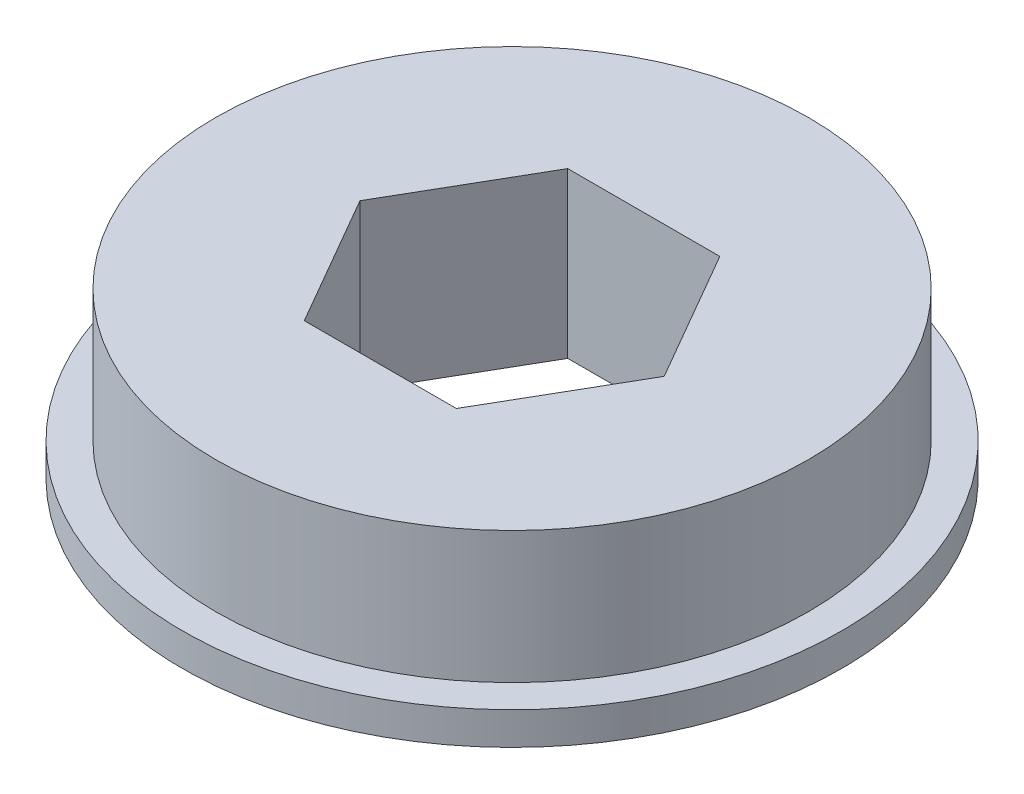
ISO-10303-21;
HEADER;
FILE_DESCRIPTION(('STEP AP214'),'2;1');
FILE_NAME('part.step','',(''),(''),'','','');
FILE_SCHEMA(('AUTOMOTIVE_DESIGN { 1 0 10303 214 1 1 1 1 }'));
ENDSEC;
DATA;
#1=APPLICATION_CONTEXT('core data for automotive mechanical design processes');
#2=APPLICATION_PROTOCOL_DEFINITION('international standard','automotive_design',2000,#1);
#3=PRODUCT_CONTEXT('',#1,'mechanical');
#4=PRODUCT('Part','Part','',(#3));
#5=PRODUCT_RELATED_PRODUCT_CATEGORY('part','',(#4));
#6=PRODUCT_DEFINITION_FORMATION('','',#4);
#7=PRODUCT_DEFINITION_CONTEXT('part definition',#1,'design');
#8=PRODUCT_DEFINITION('design','',#6,#7);
#9=PRODUCT_DEFINITION_SHAPE('','',#8);
#10=(LENGTH_UNIT() NAMED_UNIT(*) SI_UNIT(.MILLI.,.METRE.));
#11=(NAMED_UNIT(*) PLANE_ANGLE_UNIT() SI_UNIT($,.RADIAN.));
#12=(NAMED_UNIT(*) SI_UNIT($,.STERADIAN.) SOLID_ANGLE_UNIT());
#13=UNCERTAINTY_MEASURE_WITH_UNIT(LENGTH_MEASURE(1.E-05),#10,'distance_accuracy_value','');
#14=(GEOMETRIC_REPRESENTATION_CONTEXT(3) GLOBAL_UNCERTAINTY_ASSIGNED_CONTEXT((#13)) GLOBAL_UNIT_ASSIGNED_CONTEXT((#10,
#11,#12)) REPRESENTATION_CONTEXT('',''));
#15=CARTESIAN_POINT('',(0.,0.,0.));
#16=DIRECTION('',(0.,0.,1.));
#17=DIRECTION('',(1.,0.,0.));
#18=AXIS2_PLACEMENT_3D('',#15,#16,#17);
#19=CARTESIAN_POINT('',(0.,6.35,0.));
#20=DIRECTION('',(0.,1.,0.));
#21=DIRECTION('',(0.,0.,1.));
#22=AXIS2_PLACEMENT_3D('',#19,#20,#21);
#23=PLANE('',#22);
#24=CARTESIAN_POINT('',(0.,6.35,0.));
#25=DIRECTION('',(0.,1.,0.));
#26=DIRECTION('',(0.,0.,1.));
#27=AXIS2_PLACEMENT_3D('',#24,#25,#26);
#28=CIRCLE('',#27,14.2875);
#29=CARTESIAN_POINT('',(0.,6.35,14.2875));
#30=VERTEX_POINT('',#29);
#31=EDGE_CURVE('E11',#30,#30,#28,.T.);
#32=ORIENTED_EDGE('',*,*,#31,.T.);
#33=EDGE_LOOP('',(#32));
#34=FACE_BOUND('',#33,.T.);
#35=DIRECTION('',(-0.5,0.,-0.866025403784439));
#36=VECTOR('',#35,1.);
#37=CARTESIAN_POINT('',(7.33234841870825,6.35,0.));
#38=LINE('',#37,#36);
#39=CARTESIAN_POINT('',(7.33234841870825,6.35,0.));
#40=VERTEX_POINT('',#39);
#41=CARTESIAN_POINT('',(3.66617420935412,6.35,-6.35000000000001));
#42=VERTEX_POINT('',#41);
#43=EDGE_CURVE('E134',#40,#42,#38,.T.);
#44=ORIENTED_EDGE('',*,*,#43,.F.);
#45=DIRECTION('',(0.5,0.,-0.866025403784439));
#46=VECTOR('',#45,1.);
#47=CARTESIAN_POINT('',(3.66617420935412,6.35,6.35));
#48=LINE('',#47,#46);
#49=CARTESIAN_POINT('',(3.66617420935412,6.35,6.35));
#50=VERTEX_POINT('',#49);
#51=EDGE_CURVE('E132',#50,#40,#48,.T.);
#52=ORIENTED_EDGE('',*,*,#51,.F.);
#53=DIRECTION('',(1.,0.,0.));
#54=VECTOR('',#53,1.);
#55=CARTESIAN_POINT('',(-3.66617420935413,6.35,6.35000000000001));
#56=LINE('',#55,#54);
#57=CARTESIAN_POINT('',(-3.66617420935413,6.35,6.35000000000001));
#58=VERTEX_POINT('',#57);
#59=EDGE_CURVE('E57',#58,#50,#56,.T.);
#60=ORIENTED_EDGE('',*,*,#59,.F.);
#61=DIRECTION('',(0.5,0.,0.866025403784438));
#62=VECTOR('',#61,1.);
#63=CARTESIAN_POINT('',(-7.33234841870825,6.35,0.));
#64=LINE('',#63,#62);
#65=CARTESIAN_POINT('',(-7.33234841870825,6.35,0.));
#66=VERTEX_POINT('',#65);
#67=EDGE_CURVE('E139',#66,#58,#64,.T.);
#68=ORIENTED_EDGE('',*,*,#67,.F.);
#69=DIRECTION('',(-0.5,0.,0.866025403784439));
#70=VECTOR('',#69,1.);
#71=CARTESIAN_POINT('',(-3.66617420935413,6.35,-6.35000000000001));
#72=LINE('',#71,#70);
#73=CARTESIAN_POINT('',(-3.66617420935413,6.35,-6.35000000000001));
#74=VERTEX_POINT('',#73);
#75=EDGE_CURVE('E97',#74,#66,#72,.T.);
#76=ORIENTED_EDGE('',*,*,#75,.F.);
#77=DIRECTION('',(-1.,0.,0.));
#78=VECTOR('',#77,1.);
#79=CARTESIAN_POINT('',(3.66617420935412,6.35,-6.35000000000001));
#80=LINE('',#79,#78);
#81=EDGE_CURVE('E136',#42,#74,#80,.T.);
#82=ORIENTED_EDGE('',*,*,#81,.F.);
#83=EDGE_LOOP('',(#44,#52,#60,#68,#76,#82));
#84=FACE_BOUND('',#83,.T.);
#85=ADVANCED_FACE('F37',(#34,#84),#23,.T.);
#86=CARTESIAN_POINT('',(0.,6.35,0.));
#87=DIRECTION('',(0.,-1.,0.));
#88=DIRECTION('',(0.,0.,-1.));
#89=AXIS2_PLACEMENT_3D('',#86,#87,#88);
#90=CYLINDRICAL_SURFACE('',#89,14.2875);
#91=ORIENTED_EDGE('',*,*,#31,.F.);
#92=EDGE_LOOP('',(#91));
#93=FACE_BOUND('',#92,.T.);
#94=CARTESIAN_POINT('',(0.,0.,0.));
#95=DIRECTION('',(0.,-1.,0.));
#96=DIRECTION('',(0.,0.,-1.));
#97=AXIS2_PLACEMENT_3D('',#94,#95,#96);
#98=CIRCLE('',#97,14.2875);
#99=CARTESIAN_POINT('',(0.,0.,-14.2875));
#100=VERTEX_POINT('',#99);
#101=EDGE_CURVE('E127',#100,#100,#98,.T.);
#102=ORIENTED_EDGE('',*,*,#101,.F.);
#103=EDGE_LOOP('',(#102));
#104=FACE_BOUND('',#103,.T.);
#105=ADVANCED_FACE('F39',(#93,#104),#90,.T.);
#106=CARTESIAN_POINT('',(3.66617420935412,6.35,6.35));
#107=DIRECTION('',(-0.866025403784439,0.,-0.5));
#108=DIRECTION('',(-0.5,0.,0.866025403784439));
#109=AXIS2_PLACEMENT_3D('',#106,#107,#108);
#110=PLANE('',#109);
#111=DIRECTION('',(0.,-1.,0.));
#112=VECTOR('',#111,1.);
#113=CARTESIAN_POINT('',(7.33234841870825,6.35,0.));
#114=LINE('',#113,#112);
#115=CARTESIAN_POINT('',(7.33234841870825,-1.5748,0.));
#116=VERTEX_POINT('',#115);
#117=EDGE_CURVE('E45',#40,#116,#114,.T.);
#118=ORIENTED_EDGE('',*,*,#117,.T.);
#119=DIRECTION('',(-0.5,0.,0.866025403784439));
#120=VECTOR('',#119,1.);
#121=CARTESIAN_POINT('',(7.33234841870825,-1.5748,0.));
#122=LINE('',#121,#120);
#123=CARTESIAN_POINT('',(3.66617420935412,-1.5748,6.35));
#124=VERTEX_POINT('',#123);
#125=EDGE_CURVE('E118',#116,#124,#122,.T.);
#126=ORIENTED_EDGE('',*,*,#125,.T.);
#127=DIRECTION('',(0.,-1.,0.));
#128=VECTOR('',#127,1.);
#129=CARTESIAN_POINT('',(3.66617420935412,6.35,6.35));
#130=LINE('',#129,#128);
#131=EDGE_CURVE('E142',#50,#124,#130,.T.);
#132=ORIENTED_EDGE('',*,*,#131,.F.);
#133=ORIENTED_EDGE('',*,*,#51,.T.);
#134=EDGE_LOOP('',(#118,#126,#132,#133));
#135=FACE_BOUND('',#134,.T.);
#136=ADVANCED_FACE('F149',(#135),#110,.T.);
#137=CARTESIAN_POINT('',(7.33234841870825,6.35,0.));
#138=DIRECTION('',(-0.866025403784439,0.,0.5));
#139=DIRECTION('',(0.5,0.,0.866025403784439));
#140=AXIS2_PLACEMENT_3D('',#137,#138,#139);
#141=PLANE('',#140);
#142=DIRECTION('',(0.,-1.,0.));
#143=VECTOR('',#142,1.);
#144=CARTESIAN_POINT('',(3.66617420935412,6.35,-6.35000000000001));
#145=LINE('',#144,#143);
#146=CARTESIAN_POINT('',(3.66617420935413,-1.5748,-6.35));
#147=VERTEX_POINT('',#146);
#148=EDGE_CURVE('E146',#42,#147,#145,.T.);
#149=ORIENTED_EDGE('',*,*,#148,.T.);
#150=DIRECTION('',(0.5,0.,0.866025403784439));
#151=VECTOR('',#150,1.);
#152=CARTESIAN_POINT('',(3.66617420935413,-1.5748,-6.35));
#153=LINE('',#152,#151);
#154=EDGE_CURVE('E113',#147,#116,#153,.T.);
#155=ORIENTED_EDGE('',*,*,#154,.T.);
#156=ORIENTED_EDGE('',*,*,#117,.F.);
#157=ORIENTED_EDGE('',*,*,#43,.T.);
#158=EDGE_LOOP('',(#149,#155,#156,#157));
#159=FACE_BOUND('',#158,.T.);
#160=ADVANCED_FACE('F154',(#159),#141,.T.);
#161=CARTESIAN_POINT('',(3.66617420935412,6.35,-6.35000000000001));
#162=DIRECTION('',(0.,0.,1.));
#163=DIRECTION('',(1.,0.,0.));
#164=AXIS2_PLACEMENT_3D('',#161,#162,#163);
#165=PLANE('',#164);
#166=DIRECTION('',(0.,-1.,0.));
#167=VECTOR('',#166,1.);
#168=CARTESIAN_POINT('',(-3.66617420935413,6.35,-6.35000000000001));
#169=LINE('',#168,#167);
#170=CARTESIAN_POINT('',(-3.66617420935413,-1.5748,-6.35));
#171=VERTEX_POINT('',#170);
#172=EDGE_CURVE('E100',#74,#171,#169,.T.);
#173=ORIENTED_EDGE('',*,*,#172,.T.);
#174=DIRECTION('',(1.,0.,0.));
#175=VECTOR('',#174,1.);
#176=CARTESIAN_POINT('',(-3.66617420935413,-1.5748,-6.35));
#177=LINE('',#176,#175);
#178=EDGE_CURVE('E111',#171,#147,#177,.T.);
#179=ORIENTED_EDGE('',*,*,#178,.T.);
#180=ORIENTED_EDGE('',*,*,#148,.F.);
#181=ORIENTED_EDGE('',*,*,#81,.T.);
#182=EDGE_LOOP('',(#173,#179,#180,#181));
#183=FACE_BOUND('',#182,.T.);
#184=ADVANCED_FACE('F160',(#183),#165,.T.);
#185=CARTESIAN_POINT('',(-3.66617420935413,6.35,-6.35000000000001));
#186=DIRECTION('',(0.866025403784439,0.,0.5));
#187=DIRECTION('',(0.5,0.,-0.866025403784439));
#188=AXIS2_PLACEMENT_3D('',#185,#186,#187);
#189=PLANE('',#188);
#190=DIRECTION('',(0.,-1.,0.));
#191=VECTOR('',#190,1.);
#192=CARTESIAN_POINT('',(-7.33234841870825,6.35,0.));
#193=LINE('',#192,#191);
#194=CARTESIAN_POINT('',(-7.33234841870825,-1.5748,0.));
#195=VERTEX_POINT('',#194);
#196=EDGE_CURVE('E89',#66,#195,#193,.T.);
#197=ORIENTED_EDGE('',*,*,#196,.T.);
#198=DIRECTION('',(0.5,0.,-0.866025403784439));
#199=VECTOR('',#198,1.);
#200=CARTESIAN_POINT('',(-7.33234841870825,-1.5748,0.));
#201=LINE('',#200,#199);
#202=EDGE_CURVE('E94',#195,#171,#201,.T.);
#203=ORIENTED_EDGE('',*,*,#202,.T.);
#204=ORIENTED_EDGE('',*,*,#172,.F.);
#205=ORIENTED_EDGE('',*,*,#75,.T.);
#206=EDGE_LOOP('',(#197,#203,#204,#205));
#207=FACE_BOUND('',#206,.T.);
#208=ADVANCED_FACE('F91',(#207),#189,.T.);
#209=CARTESIAN_POINT('',(-7.33234841870825,6.35,0.));
#210=DIRECTION('',(0.866025403784439,0.,-0.5));
#211=DIRECTION('',(-0.5,0.,-0.866025403784439));
#212=AXIS2_PLACEMENT_3D('',#209,#210,#211);
#213=PLANE('',#212);
#214=DIRECTION('',(0.,-1.,0.));
#215=VECTOR('',#214,1.);
#216=CARTESIAN_POINT('',(-3.66617420935413,6.35,6.35000000000001));
#217=LINE('',#216,#215);
#218=CARTESIAN_POINT('',(-3.66617420935413,-1.5748,6.35));
#219=VERTEX_POINT('',#218);
#220=EDGE_CURVE('E52',#58,#219,#217,.T.);
#221=ORIENTED_EDGE('',*,*,#220,.T.);
#222=DIRECTION('',(-0.5,0.,-0.866025403784439));
#223=VECTOR('',#222,1.);
#224=CARTESIAN_POINT('',(-3.66617420935413,-1.5748,6.35));
#225=LINE('',#224,#223);
#226=EDGE_CURVE('E103',#219,#195,#225,.T.);
#227=ORIENTED_EDGE('',*,*,#226,.T.);
#228=ORIENTED_EDGE('',*,*,#196,.F.);
#229=ORIENTED_EDGE('',*,*,#67,.T.);
#230=EDGE_LOOP('',(#221,#227,#228,#229));
#231=FACE_BOUND('',#230,.T.);
#232=ADVANCED_FACE('F104',(#231),#213,.T.);
#233=CARTESIAN_POINT('',(-3.66617420935413,6.35,6.35000000000001));
#234=DIRECTION('',(0.,0.,-1.));
#235=DIRECTION('',(-1.,0.,0.));
#236=AXIS2_PLACEMENT_3D('',#233,#234,#235);
#237=PLANE('',#236);
#238=ORIENTED_EDGE('',*,*,#131,.T.);
#239=DIRECTION('',(-1.,0.,0.));
#240=VECTOR('',#239,1.);
#241=CARTESIAN_POINT('',(3.66617420935412,-1.5748,6.35));
#242=LINE('',#241,#240);
#243=EDGE_CURVE('E121',#124,#219,#242,.T.);
#244=ORIENTED_EDGE('',*,*,#243,.T.);
#245=ORIENTED_EDGE('',*,*,#220,.F.);
#246=ORIENTED_EDGE('',*,*,#59,.T.);
#247=EDGE_LOOP('',(#238,#244,#245,#246));
#248=FACE_BOUND('',#247,.T.);
#249=ADVANCED_FACE('F156',(#248),#237,.T.);
#250=CARTESIAN_POINT('',(0.,0.,0.));
#251=DIRECTION('',(0.,-1.,0.));
#252=DIRECTION('',(0.,0.,-1.));
#253=AXIS2_PLACEMENT_3D('',#250,#251,#252);
#254=PLANE('',#253);
#255=CARTESIAN_POINT('',(0.,0.,0.));
#256=DIRECTION('',(0.,-1.,0.));
#257=DIRECTION('',(0.,0.,-1.));
#258=AXIS2_PLACEMENT_3D('',#255,#256,#257);
#259=CIRCLE('',#258,15.8877);
#260=CARTESIAN_POINT('',(0.,0.,-15.8877));
#261=VERTEX_POINT('',#260);
#262=EDGE_CURVE('E123',#261,#261,#259,.T.);
#263=ORIENTED_EDGE('',*,*,#262,.F.);
#264=EDGE_LOOP('',(#263));
#265=FACE_BOUND('',#264,.T.);
#266=ORIENTED_EDGE('',*,*,#101,.T.);
#267=EDGE_LOOP('',(#266));
#268=FACE_BOUND('',#267,.T.);
#269=ADVANCED_FACE('F216',(#265,#268),#254,.F.);
#270=CARTESIAN_POINT('',(0.,-1.5748,0.));
#271=DIRECTION('',(0.,-1.,0.));
#272=DIRECTION('',(0.,0.,-1.));
#273=AXIS2_PLACEMENT_3D('',#270,#271,#272);
#274=PLANE('',#273);
#275=CARTESIAN_POINT('',(0.,-1.5748,0.));
#276=DIRECTION('',(0.,-1.,0.));
#277=DIRECTION('',(0.,0.,-1.));
#278=AXIS2_PLACEMENT_3D('',#275,#276,#277);
#279=CIRCLE('',#278,15.8877);
#280=CARTESIAN_POINT('',(0.,-1.5748,-15.8877));
#281=VERTEX_POINT('',#280);
#282=EDGE_CURVE('E124',#281,#281,#279,.T.);
#283=ORIENTED_EDGE('',*,*,#282,.T.);
#284=EDGE_LOOP('',(#283));
#285=FACE_BOUND('',#284,.T.);
#286=ORIENTED_EDGE('',*,*,#202,.F.);
#287=ORIENTED_EDGE('',*,*,#226,.F.);
#288=ORIENTED_EDGE('',*,*,#243,.F.);
#289=ORIENTED_EDGE('',*,*,#125,.F.);
#290=ORIENTED_EDGE('',*,*,#154,.F.);
#291=ORIENTED_EDGE('',*,*,#178,.F.);
#292=EDGE_LOOP('',(#286,#287,#288,#289,#290,#291));
#293=FACE_BOUND('',#292,.T.);
#294=ADVANCED_FACE('F108',(#285,#293),#274,.T.);
#295=CARTESIAN_POINT('',(0.,-1.5748,0.));
#296=DIRECTION('',(0.,1.,0.));
#297=DIRECTION('',(0.,0.,1.));
#298=AXIS2_PLACEMENT_3D('',#295,#296,#297);
#299=CYLINDRICAL_SURFACE('',#298,15.8877);
#300=ORIENTED_EDGE('',*,*,#282,.F.);
#301=EDGE_LOOP('',(#300));
#302=FACE_BOUND('',#301,.T.);
#303=ORIENTED_EDGE('',*,*,#262,.T.);
#304=EDGE_LOOP('',(#303));
#305=FACE_BOUND('',#304,.T.);
#306=ADVANCED_FACE('F236',(#302,#305),#299,.T.);
#307=CLOSED_SHELL('',(#85,#105,#136,#160,#184,#208,#232,#249,#269,#294,#306));
#308=MANIFOLD_SOLID_BREP('B2',#307);
#309=ADVANCED_BREP_SHAPE_REPRESENTATION('',(#18,#308),#14);
#310=SHAPE_DEFINITION_REPRESENTATION(#9,#309);
ENDSEC;
END-ISO-10303-21;
